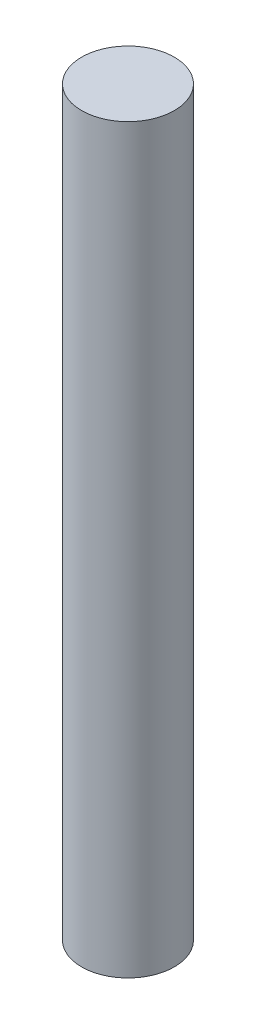
ISO-10303-21;
HEADER;
FILE_DESCRIPTION(('STEP AP214'),'2;1');
FILE_NAME('part.step','',(''),(''),'','','');
FILE_SCHEMA(('AUTOMOTIVE_DESIGN { 1 0 10303 214 1 1 1 1 }'));
ENDSEC;
DATA;
#1=APPLICATION_CONTEXT('core data for automotive mechanical design processes');
#2=APPLICATION_PROTOCOL_DEFINITION('international standard','automotive_design',2000,#1);
#3=PRODUCT_CONTEXT('',#1,'mechanical');
#4=PRODUCT('Part','Part','',(#3));
#5=PRODUCT_RELATED_PRODUCT_CATEGORY('part','',(#4));
#6=PRODUCT_DEFINITION_FORMATION('','',#4);
#7=PRODUCT_DEFINITION_CONTEXT('part definition',#1,'design');
#8=PRODUCT_DEFINITION('design','',#6,#7);
#9=PRODUCT_DEFINITION_SHAPE('','',#8);
#10=(LENGTH_UNIT() NAMED_UNIT(*) SI_UNIT(.MILLI.,.METRE.));
#11=(NAMED_UNIT(*) PLANE_ANGLE_UNIT() SI_UNIT($,.RADIAN.));
#12=(NAMED_UNIT(*) SI_UNIT($,.STERADIAN.) SOLID_ANGLE_UNIT());
#13=UNCERTAINTY_MEASURE_WITH_UNIT(LENGTH_MEASURE(1.E-05),#10,'distance_accuracy_value','');
#14=(GEOMETRIC_REPRESENTATION_CONTEXT(3) GLOBAL_UNCERTAINTY_ASSIGNED_CONTEXT((#13)) GLOBAL_UNIT_ASSIGNED_CONTEXT((#10,
#11,#12)) REPRESENTATION_CONTEXT('',''));
#15=CARTESIAN_POINT('',(0.,0.,0.));
#16=DIRECTION('',(0.,0.,1.));
#17=DIRECTION('',(1.,0.,0.));
#18=AXIS2_PLACEMENT_3D('',#15,#16,#17);
#19=CARTESIAN_POINT('',(0.,25.4,0.));
#20=DIRECTION('',(0.,-1.,0.));
#21=DIRECTION('',(0.,0.,-1.));
#22=AXIS2_PLACEMENT_3D('',#19,#20,#21);
#23=CYLINDRICAL_SURFACE('',#22,1.5875);
#24=CARTESIAN_POINT('',(0.,25.4,0.));
#25=DIRECTION('',(0.,1.,0.));
#26=DIRECTION('',(0.,0.,1.));
#27=AXIS2_PLACEMENT_3D('',#24,#25,#26);
#28=CIRCLE('',#27,1.5875);
#29=CARTESIAN_POINT('',(0.,25.4,1.5875));
#30=VERTEX_POINT('',#29);
#31=EDGE_CURVE('E10',#30,#30,#28,.T.);
#32=ORIENTED_EDGE('',*,*,#31,.F.);
#33=EDGE_LOOP('',(#32));
#34=FACE_BOUND('',#33,.T.);
#35=CARTESIAN_POINT('',(0.,0.,0.));
#36=DIRECTION('',(0.,1.,0.));
#37=DIRECTION('',(0.,0.,1.));
#38=AXIS2_PLACEMENT_3D('',#35,#36,#37);
#39=CIRCLE('',#38,1.5875);
#40=CARTESIAN_POINT('',(0.,0.,1.5875));
#41=VERTEX_POINT('',#40);
#42=EDGE_CURVE('E40',#41,#41,#39,.T.);
#43=ORIENTED_EDGE('',*,*,#42,.T.);
#44=EDGE_LOOP('',(#43));
#45=FACE_BOUND('',#44,.T.);
#46=ADVANCED_FACE('F37',(#34,#45),#23,.T.);
#47=CARTESIAN_POINT('',(0.,25.4,0.));
#48=DIRECTION('',(0.,1.,0.));
#49=DIRECTION('',(0.,0.,1.));
#50=AXIS2_PLACEMENT_3D('',#47,#48,#49);
#51=PLANE('',#50);
#52=ORIENTED_EDGE('',*,*,#31,.T.);
#53=EDGE_LOOP('',(#52));
#54=FACE_BOUND('',#53,.T.);
#55=ADVANCED_FACE('F52',(#54),#51,.T.);
#56=CARTESIAN_POINT('',(0.,0.,0.));
#57=DIRECTION('',(0.,1.,0.));
#58=DIRECTION('',(0.,0.,1.));
#59=AXIS2_PLACEMENT_3D('',#56,#57,#58);
#60=PLANE('',#59);
#61=ORIENTED_EDGE('',*,*,#42,.F.);
#62=EDGE_LOOP('',(#61));
#63=FACE_BOUND('',#62,.T.);
#64=ADVANCED_FACE('F50',(#63),#60,.F.);
#65=CLOSED_SHELL('',(#46,#55,#64));
#66=MANIFOLD_SOLID_BREP('B2',#65);
#67=ADVANCED_BREP_SHAPE_REPRESENTATION('',(#18,#66),#14);
#68=SHAPE_DEFINITION_REPRESENTATION(#9,#67);
ENDSEC;
END-ISO-10303-21;
